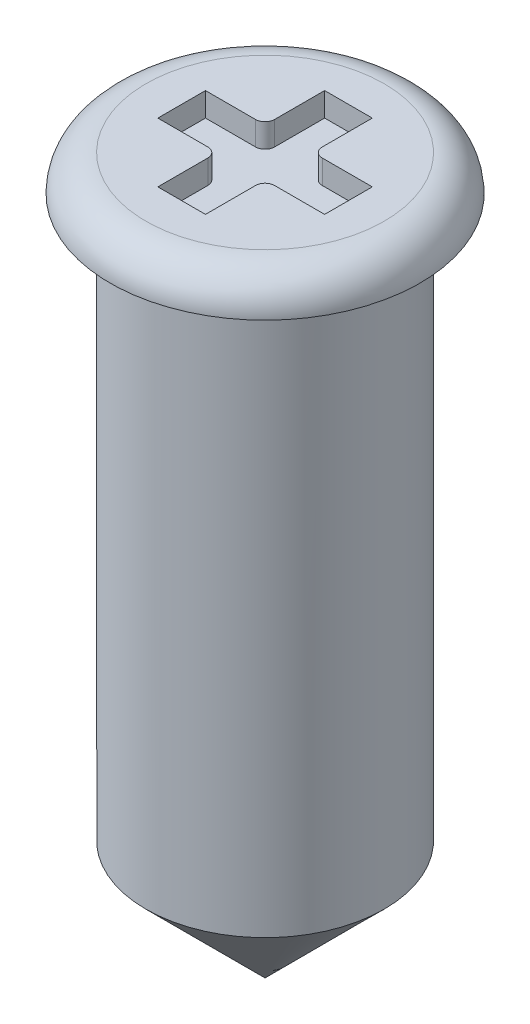
ISO-10303-21;
HEADER;
FILE_DESCRIPTION(('STEP AP214'),'2;1');
FILE_NAME('part.step','',(''),(''),'','','');
FILE_SCHEMA(('AUTOMOTIVE_DESIGN { 1 0 10303 214 1 1 1 1 }'));
ENDSEC;
DATA;
#1=APPLICATION_CONTEXT('core data for automotive mechanical design processes');
#2=APPLICATION_PROTOCOL_DEFINITION('international standard','automotive_design',2000,#1);
#3=PRODUCT_CONTEXT('',#1,'mechanical');
#4=PRODUCT('Part','Part','',(#3));
#5=PRODUCT_RELATED_PRODUCT_CATEGORY('part','',(#4));
#6=PRODUCT_DEFINITION_FORMATION('','',#4);
#7=PRODUCT_DEFINITION_CONTEXT('part definition',#1,'design');
#8=PRODUCT_DEFINITION('design','',#6,#7);
#9=PRODUCT_DEFINITION_SHAPE('','',#8);
#10=(LENGTH_UNIT() NAMED_UNIT(*) SI_UNIT(.MILLI.,.METRE.));
#11=(NAMED_UNIT(*) PLANE_ANGLE_UNIT() SI_UNIT($,.RADIAN.));
#12=(NAMED_UNIT(*) SI_UNIT($,.STERADIAN.) SOLID_ANGLE_UNIT());
#13=UNCERTAINTY_MEASURE_WITH_UNIT(LENGTH_MEASURE(1.E-05),#10,'distance_accuracy_value','');
#14=(GEOMETRIC_REPRESENTATION_CONTEXT(3) GLOBAL_UNCERTAINTY_ASSIGNED_CONTEXT((#13)) GLOBAL_UNIT_ASSIGNED_CONTEXT((#10,
#11,#12)) REPRESENTATION_CONTEXT('',''));
#15=CARTESIAN_POINT('',(0.,0.,0.));
#16=DIRECTION('',(0.,0.,1.));
#17=DIRECTION('',(1.,0.,0.));
#18=AXIS2_PLACEMENT_3D('',#15,#16,#17);
#19=CARTESIAN_POINT('',(0.,-22.5160076961522,0.));
#20=DIRECTION('',(0.,1.,0.));
#21=DIRECTION('',(0.,0.,1.));
#22=AXIS2_PLACEMENT_3D('',#19,#20,#21);
#23=CONICAL_SURFACE('',#22,0.,0.785398163397448);
#24=CARTESIAN_POINT('',(0.,-22.0160076961522,0.));
#25=DIRECTION('',(0.,-1.,0.));
#26=DIRECTION('',(0.,0.,-1.));
#27=AXIS2_PLACEMENT_3D('',#24,#25,#26);
#28=CIRCLE('',#27,0.5);
#29=CARTESIAN_POINT('',(0.,-22.0160076961522,-0.5));
#30=VERTEX_POINT('',#29);
#31=EDGE_CURVE('E11',#30,#30,#28,.T.);
#32=ORIENTED_EDGE('',*,*,#31,.T.);
#33=EDGE_LOOP('',(#32));
#34=FACE_BOUND('',#33,.T.);
#35=CARTESIAN_POINT('',(0.,-22.5160076961522,0.));
#36=VERTEX_POINT('',#35);
#37=VERTEX_LOOP('',#36);
#38=FACE_BOUND('',#37,.T.);
#39=ADVANCED_FACE('F45',(#34,#38),#23,.T.);
#40=CARTESIAN_POINT('',(0.,-22.5160076961522,0.));
#41=DIRECTION('',(0.,-1.,0.));
#42=DIRECTION('',(0.,0.,-1.));
#43=AXIS2_PLACEMENT_3D('',#40,#41,#42);
#44=CYLINDRICAL_SURFACE('',#43,0.5);
#45=CARTESIAN_POINT('',(0.,-19.6660076961522,0.));
#46=DIRECTION('',(0.,-1.,0.));
#47=DIRECTION('',(0.,0.,-1.));
#48=AXIS2_PLACEMENT_3D('',#45,#46,#47);
#49=CIRCLE('',#48,0.5);
#50=CARTESIAN_POINT('',(0.,-19.6660076961522,-0.5));
#51=VERTEX_POINT('',#50);
#52=EDGE_CURVE('E52',#51,#51,#49,.T.);
#53=ORIENTED_EDGE('',*,*,#52,.T.);
#54=EDGE_LOOP('',(#53));
#55=FACE_BOUND('',#54,.T.);
#56=ORIENTED_EDGE('',*,*,#31,.F.);
#57=EDGE_LOOP('',(#56));
#58=FACE_BOUND('',#57,.T.);
#59=ADVANCED_FACE('F299',(#55,#58),#44,.T.);
#60=CARTESIAN_POINT('',(0.65,-19.6660076961522,0.));
#61=DIRECTION('',(0.,-1.,0.));
#62=DIRECTION('',(0.,0.,-1.));
#63=AXIS2_PLACEMENT_3D('',#60,#61,#62);
#64=PLANE('',#63);
#65=CARTESIAN_POINT('',(0.,-19.6660076961522,0.));
#66=DIRECTION('',(0.,-1.,0.));
#67=DIRECTION('',(0.,0.,-1.));
#68=AXIS2_PLACEMENT_3D('',#65,#66,#67);
#69=CIRCLE('',#68,0.650000000000002);
#70=CARTESIAN_POINT('',(0.,-19.6660076961522,-0.650000000000002));
#71=VERTEX_POINT('',#70);
#72=EDGE_CURVE('E294',#71,#71,#69,.T.);
#73=ORIENTED_EDGE('',*,*,#72,.T.);
#74=EDGE_LOOP('',(#73));
#75=FACE_BOUND('',#74,.T.);
#76=ORIENTED_EDGE('',*,*,#52,.F.);
#77=EDGE_LOOP('',(#76));
#78=FACE_BOUND('',#77,.T.);
#79=ADVANCED_FACE('F302',(#75,#78),#64,.T.);
#80=CARTESIAN_POINT('',(0.,-19.6660076961522,0.));
#81=DIRECTION('',(0.,-1.,0.));
#82=DIRECTION('',(0.,0.,-1.));
#83=AXIS2_PLACEMENT_3D('',#80,#81,#82);
#84=TOROIDAL_SURFACE('',#83,0.5,0.150000000000002);
#85=CARTESIAN_POINT('',(0.,-19.5160076961522,0.));
#86=DIRECTION('',(0.,-1.,0.));
#87=DIRECTION('',(0.,0.,-1.));
#88=AXIS2_PLACEMENT_3D('',#85,#86,#87);
#89=CIRCLE('',#88,0.5);
#90=CARTESIAN_POINT('',(0.,-19.5160076961522,-0.5));
#91=VERTEX_POINT('',#90);
#92=EDGE_CURVE('E264',#91,#91,#89,.T.);
#93=ORIENTED_EDGE('',*,*,#92,.T.);
#94=EDGE_LOOP('',(#93));
#95=FACE_BOUND('',#94,.T.);
#96=ORIENTED_EDGE('',*,*,#72,.F.);
#97=EDGE_LOOP('',(#96));
#98=FACE_BOUND('',#97,.T.);
#99=ADVANCED_FACE('F304',(#95,#98),#84,.T.);
#100=CARTESIAN_POINT('',(0.,-19.5160076961522,0.));
#101=DIRECTION('',(0.,1.,0.));
#102=DIRECTION('',(0.,0.,1.));
#103=AXIS2_PLACEMENT_3D('',#100,#101,#102);
#104=PLANE('',#103);
#105=DIRECTION('',(0.,0.,-1.));
#106=VECTOR('',#105,1.);
#107=CARTESIAN_POINT('',(0.0999999999999998,-19.5160076961522,-0.35));
#108=LINE('',#107,#106);
#109=CARTESIAN_POINT('',(0.0999999999999999,-19.5160076961522,-0.14));
#110=VERTEX_POINT('',#109);
#111=CARTESIAN_POINT('',(0.0999999999999998,-19.5160076961522,-0.35));
#112=VERTEX_POINT('',#111);
#113=EDGE_CURVE('E59',#110,#112,#108,.T.);
#114=ORIENTED_EDGE('',*,*,#113,.F.);
#115=CARTESIAN_POINT('',(0.14,-19.5160076961522,-0.14));
#116=DIRECTION('',(0.,-1.,0.));
#117=DIRECTION('',(0.,0.,1.));
#118=AXIS2_PLACEMENT_3D('',#115,#116,#117);
#119=CIRCLE('',#118,0.04);
#120=CARTESIAN_POINT('',(0.14,-19.5160076961522,-0.1));
#121=VERTEX_POINT('',#120);
#122=EDGE_CURVE('E178',#121,#110,#119,.T.);
#123=ORIENTED_EDGE('',*,*,#122,.F.);
#124=DIRECTION('',(-1.,0.,0.));
#125=VECTOR('',#124,1.);
#126=CARTESIAN_POINT('',(0.14,-19.5160076961522,-0.1));
#127=LINE('',#126,#125);
#128=CARTESIAN_POINT('',(0.35,-19.5160076961522,-0.0999999999999999));
#129=VERTEX_POINT('',#128);
#130=EDGE_CURVE('E181',#129,#121,#127,.T.);
#131=ORIENTED_EDGE('',*,*,#130,.F.);
#132=DIRECTION('',(0.,0.,-1.));
#133=VECTOR('',#132,1.);
#134=CARTESIAN_POINT('',(0.35,-19.5160076961522,-0.0999999999999999));
#135=LINE('',#134,#133);
#136=CARTESIAN_POINT('',(0.35,-19.5160076961522,0.1));
#137=VERTEX_POINT('',#136);
#138=EDGE_CURVE('E257',#137,#129,#135,.T.);
#139=ORIENTED_EDGE('',*,*,#138,.F.);
#140=DIRECTION('',(1.,0.,0.));
#141=VECTOR('',#140,1.);
#142=CARTESIAN_POINT('',(0.35,-19.5160076961522,0.1));
#143=LINE('',#142,#141);
#144=CARTESIAN_POINT('',(0.14,-19.5160076961522,0.1));
#145=VERTEX_POINT('',#144);
#146=EDGE_CURVE('E254',#145,#137,#143,.T.);
#147=ORIENTED_EDGE('',*,*,#146,.F.);
#148=CARTESIAN_POINT('',(0.14,-19.5160076961522,0.14));
#149=DIRECTION('',(0.,-1.,0.));
#150=DIRECTION('',(0.,0.,1.));
#151=AXIS2_PLACEMENT_3D('',#148,#149,#150);
#152=CIRCLE('',#151,0.04);
#153=CARTESIAN_POINT('',(0.1,-19.5160076961522,0.14));
#154=VERTEX_POINT('',#153);
#155=EDGE_CURVE('E251',#154,#145,#152,.T.);
#156=ORIENTED_EDGE('',*,*,#155,.F.);
#157=DIRECTION('',(0.,0.,-1.));
#158=VECTOR('',#157,1.);
#159=CARTESIAN_POINT('',(0.1,-19.5160076961522,0.14));
#160=LINE('',#159,#158);
#161=CARTESIAN_POINT('',(0.1,-19.5160076961522,0.35));
#162=VERTEX_POINT('',#161);
#163=EDGE_CURVE('E248',#162,#154,#160,.T.);
#164=ORIENTED_EDGE('',*,*,#163,.F.);
#165=DIRECTION('',(1.,0.,0.));
#166=VECTOR('',#165,1.);
#167=CARTESIAN_POINT('',(0.1,-19.5160076961522,0.35));
#168=LINE('',#167,#166);
#169=CARTESIAN_POINT('',(-0.1,-19.5160076961522,0.35));
#170=VERTEX_POINT('',#169);
#171=EDGE_CURVE('E245',#170,#162,#168,.T.);
#172=ORIENTED_EDGE('',*,*,#171,.F.);
#173=DIRECTION('',(0.,0.,1.));
#174=VECTOR('',#173,1.);
#175=CARTESIAN_POINT('',(-0.1,-19.5160076961522,0.14));
#176=LINE('',#175,#174);
#177=CARTESIAN_POINT('',(-0.1,-19.5160076961522,0.14));
#178=VERTEX_POINT('',#177);
#179=EDGE_CURVE('E242',#178,#170,#176,.T.);
#180=ORIENTED_EDGE('',*,*,#179,.F.);
#181=CARTESIAN_POINT('',(-0.14,-19.5160076961522,0.14));
#182=DIRECTION('',(0.,-1.,0.));
#183=DIRECTION('',(0.,0.,-1.));
#184=AXIS2_PLACEMENT_3D('',#181,#182,#183);
#185=CIRCLE('',#184,0.04);
#186=CARTESIAN_POINT('',(-0.14,-19.5160076961522,0.1));
#187=VERTEX_POINT('',#186);
#188=EDGE_CURVE('E239',#187,#178,#185,.T.);
#189=ORIENTED_EDGE('',*,*,#188,.F.);
#190=DIRECTION('',(1.,0.,0.));
#191=VECTOR('',#190,1.);
#192=CARTESIAN_POINT('',(-0.35,-19.5160076961522,0.1));
#193=LINE('',#192,#191);
#194=CARTESIAN_POINT('',(-0.35,-19.5160076961522,0.1));
#195=VERTEX_POINT('',#194);
#196=EDGE_CURVE('E236',#195,#187,#193,.T.);
#197=ORIENTED_EDGE('',*,*,#196,.F.);
#198=DIRECTION('',(0.,0.,1.));
#199=VECTOR('',#198,1.);
#200=CARTESIAN_POINT('',(-0.35,-19.5160076961522,-0.0999999999999999));
#201=LINE('',#200,#199);
#202=CARTESIAN_POINT('',(-0.35,-19.5160076961522,-0.0999999999999999));
#203=VERTEX_POINT('',#202);
#204=EDGE_CURVE('E233',#203,#195,#201,.T.);
#205=ORIENTED_EDGE('',*,*,#204,.F.);
#206=DIRECTION('',(-1.,0.,0.));
#207=VECTOR('',#206,1.);
#208=CARTESIAN_POINT('',(-0.14,-19.5160076961522,-0.1));
#209=LINE('',#208,#207);
#210=CARTESIAN_POINT('',(-0.14,-19.5160076961522,-0.1));
#211=VERTEX_POINT('',#210);
#212=EDGE_CURVE('E230',#211,#203,#209,.T.);
#213=ORIENTED_EDGE('',*,*,#212,.F.);
#214=CARTESIAN_POINT('',(-0.14,-19.5160076961522,-0.14));
#215=DIRECTION('',(0.,-1.,0.));
#216=DIRECTION('',(0.,0.,-1.));
#217=AXIS2_PLACEMENT_3D('',#214,#215,#216);
#218=CIRCLE('',#217,0.04);
#219=CARTESIAN_POINT('',(-0.0999999999999999,-19.5160076961522,-0.14));
#220=VERTEX_POINT('',#219);
#221=EDGE_CURVE('E227',#220,#211,#218,.T.);
#222=ORIENTED_EDGE('',*,*,#221,.F.);
#223=DIRECTION('',(0.,0.,1.));
#224=VECTOR('',#223,1.);
#225=CARTESIAN_POINT('',(-0.0999999999999998,-19.5160076961522,-0.35));
#226=LINE('',#225,#224);
#227=CARTESIAN_POINT('',(-0.0999999999999998,-19.5160076961522,-0.35));
#228=VERTEX_POINT('',#227);
#229=EDGE_CURVE('E224',#228,#220,#226,.T.);
#230=ORIENTED_EDGE('',*,*,#229,.F.);
#231=DIRECTION('',(-1.,0.,0.));
#232=VECTOR('',#231,1.);
#233=CARTESIAN_POINT('',(-0.0999999999999998,-19.5160076961522,-0.35));
#234=LINE('',#233,#232);
#235=EDGE_CURVE('E222',#112,#228,#234,.T.);
#236=ORIENTED_EDGE('',*,*,#235,.F.);
#237=EDGE_LOOP('',(#114,#123,#131,#139,#147,#156,#164,#172,#180,#189,#197,#205,#213,#222,#230,#236));
#238=FACE_BOUND('',#237,.T.);
#239=ORIENTED_EDGE('',*,*,#92,.F.);
#240=EDGE_LOOP('',(#239));
#241=FACE_BOUND('',#240,.T.);
#242=ADVANCED_FACE('F311',(#238,#241),#104,.T.);
#243=CARTESIAN_POINT('',(0.0999999999999998,-19.6160076961522,-0.35));
#244=DIRECTION('',(1.,0.,0.));
#245=DIRECTION('',(0.,0.,-1.));
#246=AXIS2_PLACEMENT_3D('',#243,#244,#245);
#247=PLANE('',#246);
#248=ORIENTED_EDGE('',*,*,#113,.T.);
#249=DIRECTION('',(0.,1.,0.));
#250=VECTOR('',#249,1.);
#251=CARTESIAN_POINT('',(0.0999999999999998,-19.6160076961522,-0.35));
#252=LINE('',#251,#250);
#253=CARTESIAN_POINT('',(0.0999999999999998,-19.6160076961522,-0.35));
#254=VERTEX_POINT('',#253);
#255=EDGE_CURVE('E155',#254,#112,#252,.T.);
#256=ORIENTED_EDGE('',*,*,#255,.F.);
#257=DIRECTION('',(0.,0.,-1.));
#258=VECTOR('',#257,1.);
#259=CARTESIAN_POINT('',(0.0999999999999998,-19.6160076961522,-0.35));
#260=LINE('',#259,#258);
#261=CARTESIAN_POINT('',(0.0999999999999999,-19.6160076961522,-0.14));
#262=VERTEX_POINT('',#261);
#263=EDGE_CURVE('E159',#262,#254,#260,.T.);
#264=ORIENTED_EDGE('',*,*,#263,.F.);
#265=DIRECTION('',(0.,1.,0.));
#266=VECTOR('',#265,1.);
#267=CARTESIAN_POINT('',(0.0999999999999999,-19.6160076961522,-0.14));
#268=LINE('',#267,#266);
#269=EDGE_CURVE('E262',#262,#110,#268,.T.);
#270=ORIENTED_EDGE('',*,*,#269,.T.);
#271=EDGE_LOOP('',(#248,#256,#264,#270));
#272=FACE_BOUND('',#271,.T.);
#273=ADVANCED_FACE('F157',(#272),#247,.F.);
#274=CARTESIAN_POINT('',(0.14,-19.6160076961522,-0.14));
#275=DIRECTION('',(0.,1.,0.));
#276=DIRECTION('',(0.,0.,1.));
#277=AXIS2_PLACEMENT_3D('',#274,#275,#276);
#278=CYLINDRICAL_SURFACE('',#277,0.04);
#279=ORIENTED_EDGE('',*,*,#122,.T.);
#280=ORIENTED_EDGE('',*,*,#269,.F.);
#281=CARTESIAN_POINT('',(0.14,-19.6160076961522,-0.14));
#282=DIRECTION('',(0.,-1.,0.));
#283=DIRECTION('',(0.,0.,1.));
#284=AXIS2_PLACEMENT_3D('',#281,#282,#283);
#285=CIRCLE('',#284,0.04);
#286=CARTESIAN_POINT('',(0.14,-19.6160076961522,-0.1));
#287=VERTEX_POINT('',#286);
#288=EDGE_CURVE('E165',#287,#262,#285,.T.);
#289=ORIENTED_EDGE('',*,*,#288,.F.);
#290=DIRECTION('',(0.,1.,0.));
#291=VECTOR('',#290,1.);
#292=CARTESIAN_POINT('',(0.14,-19.6160076961522,-0.1));
#293=LINE('',#292,#291);
#294=EDGE_CURVE('E265',#287,#121,#293,.T.);
#295=ORIENTED_EDGE('',*,*,#294,.T.);
#296=EDGE_LOOP('',(#279,#280,#289,#295));
#297=FACE_BOUND('',#296,.T.);
#298=ADVANCED_FACE('F363',(#297),#278,.T.);
#299=CARTESIAN_POINT('',(0.14,-19.6160076961522,-0.1));
#300=DIRECTION('',(0.,0.,-1.));
#301=DIRECTION('',(-1.,0.,0.));
#302=AXIS2_PLACEMENT_3D('',#299,#300,#301);
#303=PLANE('',#302);
#304=ORIENTED_EDGE('',*,*,#130,.T.);
#305=ORIENTED_EDGE('',*,*,#294,.F.);
#306=DIRECTION('',(-1.,0.,0.));
#307=VECTOR('',#306,1.);
#308=CARTESIAN_POINT('',(0.14,-19.6160076961522,-0.1));
#309=LINE('',#308,#307);
#310=CARTESIAN_POINT('',(0.35,-19.6160076961522,-0.0999999999999999));
#311=VERTEX_POINT('',#310);
#312=EDGE_CURVE('E218',#311,#287,#309,.T.);
#313=ORIENTED_EDGE('',*,*,#312,.F.);
#314=DIRECTION('',(0.,1.,0.));
#315=VECTOR('',#314,1.);
#316=CARTESIAN_POINT('',(0.35,-19.6160076961522,-0.0999999999999999));
#317=LINE('',#316,#315);
#318=EDGE_CURVE('E267',#311,#129,#317,.T.);
#319=ORIENTED_EDGE('',*,*,#318,.T.);
#320=EDGE_LOOP('',(#304,#305,#313,#319));
#321=FACE_BOUND('',#320,.T.);
#322=ADVANCED_FACE('F373',(#321),#303,.F.);
#323=CARTESIAN_POINT('',(0.35,-19.6160076961522,-0.0999999999999999));
#324=DIRECTION('',(1.,0.,0.));
#325=DIRECTION('',(0.,0.,-1.));
#326=AXIS2_PLACEMENT_3D('',#323,#324,#325);
#327=PLANE('',#326);
#328=ORIENTED_EDGE('',*,*,#138,.T.);
#329=ORIENTED_EDGE('',*,*,#318,.F.);
#330=DIRECTION('',(0.,0.,-1.));
#331=VECTOR('',#330,1.);
#332=CARTESIAN_POINT('',(0.35,-19.6160076961522,-0.0999999999999999));
#333=LINE('',#332,#331);
#334=CARTESIAN_POINT('',(0.35,-19.6160076961522,0.1));
#335=VERTEX_POINT('',#334);
#336=EDGE_CURVE('E215',#335,#311,#333,.T.);
#337=ORIENTED_EDGE('',*,*,#336,.F.);
#338=DIRECTION('',(0.,1.,0.));
#339=VECTOR('',#338,1.);
#340=CARTESIAN_POINT('',(0.35,-19.6160076961522,0.1));
#341=LINE('',#340,#339);
#342=EDGE_CURVE('E269',#335,#137,#341,.T.);
#343=ORIENTED_EDGE('',*,*,#342,.T.);
#344=EDGE_LOOP('',(#328,#329,#337,#343));
#345=FACE_BOUND('',#344,.T.);
#346=ADVANCED_FACE('F384',(#345),#327,.F.);
#347=CARTESIAN_POINT('',(0.35,-19.6160076961522,0.1));
#348=DIRECTION('',(0.,0.,1.));
#349=DIRECTION('',(1.,0.,0.));
#350=AXIS2_PLACEMENT_3D('',#347,#348,#349);
#351=PLANE('',#350);
#352=ORIENTED_EDGE('',*,*,#146,.T.);
#353=ORIENTED_EDGE('',*,*,#342,.F.);
#354=DIRECTION('',(1.,0.,0.));
#355=VECTOR('',#354,1.);
#356=CARTESIAN_POINT('',(0.35,-19.6160076961522,0.1));
#357=LINE('',#356,#355);
#358=CARTESIAN_POINT('',(0.14,-19.6160076961522,0.1));
#359=VERTEX_POINT('',#358);
#360=EDGE_CURVE('E212',#359,#335,#357,.T.);
#361=ORIENTED_EDGE('',*,*,#360,.F.);
#362=DIRECTION('',(0.,1.,0.));
#363=VECTOR('',#362,1.);
#364=CARTESIAN_POINT('',(0.14,-19.6160076961522,0.1));
#365=LINE('',#364,#363);
#366=EDGE_CURVE('E271',#359,#145,#365,.T.);
#367=ORIENTED_EDGE('',*,*,#366,.T.);
#368=EDGE_LOOP('',(#352,#353,#361,#367));
#369=FACE_BOUND('',#368,.T.);
#370=ADVANCED_FACE('F395',(#369),#351,.F.);
#371=CARTESIAN_POINT('',(0.14,-19.6160076961522,0.14));
#372=DIRECTION('',(0.,1.,0.));
#373=DIRECTION('',(0.,0.,1.));
#374=AXIS2_PLACEMENT_3D('',#371,#372,#373);
#375=CYLINDRICAL_SURFACE('',#374,0.04);
#376=ORIENTED_EDGE('',*,*,#155,.T.);
#377=ORIENTED_EDGE('',*,*,#366,.F.);
#378=CARTESIAN_POINT('',(0.14,-19.6160076961522,0.14));
#379=DIRECTION('',(0.,-1.,0.));
#380=DIRECTION('',(0.,0.,1.));
#381=AXIS2_PLACEMENT_3D('',#378,#379,#380);
#382=CIRCLE('',#381,0.04);
#383=CARTESIAN_POINT('',(0.1,-19.6160076961522,0.14));
#384=VERTEX_POINT('',#383);
#385=EDGE_CURVE('E209',#384,#359,#382,.T.);
#386=ORIENTED_EDGE('',*,*,#385,.F.);
#387=DIRECTION('',(0.,1.,0.));
#388=VECTOR('',#387,1.);
#389=CARTESIAN_POINT('',(0.1,-19.6160076961522,0.14));
#390=LINE('',#389,#388);
#391=EDGE_CURVE('E273',#384,#154,#390,.T.);
#392=ORIENTED_EDGE('',*,*,#391,.T.);
#393=EDGE_LOOP('',(#376,#377,#386,#392));
#394=FACE_BOUND('',#393,.T.);
#395=ADVANCED_FACE('F406',(#394),#375,.T.);
#396=CARTESIAN_POINT('',(0.1,-19.6160076961522,0.14));
#397=DIRECTION('',(1.,0.,0.));
#398=DIRECTION('',(0.,0.,-1.));
#399=AXIS2_PLACEMENT_3D('',#396,#397,#398);
#400=PLANE('',#399);
#401=ORIENTED_EDGE('',*,*,#163,.T.);
#402=ORIENTED_EDGE('',*,*,#391,.F.);
#403=DIRECTION('',(0.,0.,-1.));
#404=VECTOR('',#403,1.);
#405=CARTESIAN_POINT('',(0.1,-19.6160076961522,0.14));
#406=LINE('',#405,#404);
#407=CARTESIAN_POINT('',(0.1,-19.6160076961522,0.35));
#408=VERTEX_POINT('',#407);
#409=EDGE_CURVE('E206',#408,#384,#406,.T.);
#410=ORIENTED_EDGE('',*,*,#409,.F.);
#411=DIRECTION('',(0.,1.,0.));
#412=VECTOR('',#411,1.);
#413=CARTESIAN_POINT('',(0.1,-19.6160076961522,0.35));
#414=LINE('',#413,#412);
#415=EDGE_CURVE('E275',#408,#162,#414,.T.);
#416=ORIENTED_EDGE('',*,*,#415,.T.);
#417=EDGE_LOOP('',(#401,#402,#410,#416));
#418=FACE_BOUND('',#417,.T.);
#419=ADVANCED_FACE('F417',(#418),#400,.F.);
#420=CARTESIAN_POINT('',(0.1,-19.6160076961522,0.35));
#421=DIRECTION('',(0.,0.,1.));
#422=DIRECTION('',(1.,0.,0.));
#423=AXIS2_PLACEMENT_3D('',#420,#421,#422);
#424=PLANE('',#423);
#425=ORIENTED_EDGE('',*,*,#171,.T.);
#426=ORIENTED_EDGE('',*,*,#415,.F.);
#427=DIRECTION('',(1.,0.,0.));
#428=VECTOR('',#427,1.);
#429=CARTESIAN_POINT('',(0.1,-19.6160076961522,0.35));
#430=LINE('',#429,#428);
#431=CARTESIAN_POINT('',(-0.1,-19.6160076961522,0.35));
#432=VERTEX_POINT('',#431);
#433=EDGE_CURVE('E203',#432,#408,#430,.T.);
#434=ORIENTED_EDGE('',*,*,#433,.F.);
#435=DIRECTION('',(0.,1.,0.));
#436=VECTOR('',#435,1.);
#437=CARTESIAN_POINT('',(-0.1,-19.6160076961522,0.35));
#438=LINE('',#437,#436);
#439=EDGE_CURVE('E277',#432,#170,#438,.T.);
#440=ORIENTED_EDGE('',*,*,#439,.T.);
#441=EDGE_LOOP('',(#425,#426,#434,#440));
#442=FACE_BOUND('',#441,.T.);
#443=ADVANCED_FACE('F428',(#442),#424,.F.);
#444=CARTESIAN_POINT('',(-0.1,-19.6160076961522,0.14));
#445=DIRECTION('',(-1.,0.,0.));
#446=DIRECTION('',(0.,0.,1.));
#447=AXIS2_PLACEMENT_3D('',#444,#445,#446);
#448=PLANE('',#447);
#449=ORIENTED_EDGE('',*,*,#179,.T.);
#450=ORIENTED_EDGE('',*,*,#439,.F.);
#451=DIRECTION('',(0.,0.,1.));
#452=VECTOR('',#451,1.);
#453=CARTESIAN_POINT('',(-0.1,-19.6160076961522,0.14));
#454=LINE('',#453,#452);
#455=CARTESIAN_POINT('',(-0.1,-19.6160076961522,0.14));
#456=VERTEX_POINT('',#455);
#457=EDGE_CURVE('E200',#456,#432,#454,.T.);
#458=ORIENTED_EDGE('',*,*,#457,.F.);
#459=DIRECTION('',(0.,1.,0.));
#460=VECTOR('',#459,1.);
#461=CARTESIAN_POINT('',(-0.1,-19.6160076961522,0.14));
#462=LINE('',#461,#460);
#463=EDGE_CURVE('E279',#456,#178,#462,.T.);
#464=ORIENTED_EDGE('',*,*,#463,.T.);
#465=EDGE_LOOP('',(#449,#450,#458,#464));
#466=FACE_BOUND('',#465,.T.);
#467=ADVANCED_FACE('F439',(#466),#448,.F.);
#468=CARTESIAN_POINT('',(-0.14,-19.6160076961522,0.14));
#469=DIRECTION('',(0.,1.,0.));
#470=DIRECTION('',(0.,0.,1.));
#471=AXIS2_PLACEMENT_3D('',#468,#469,#470);
#472=CYLINDRICAL_SURFACE('',#471,0.04);
#473=ORIENTED_EDGE('',*,*,#188,.T.);
#474=ORIENTED_EDGE('',*,*,#463,.F.);
#475=CARTESIAN_POINT('',(-0.14,-19.6160076961522,0.14));
#476=DIRECTION('',(0.,-1.,0.));
#477=DIRECTION('',(0.,0.,-1.));
#478=AXIS2_PLACEMENT_3D('',#475,#476,#477);
#479=CIRCLE('',#478,0.04);
#480=CARTESIAN_POINT('',(-0.14,-19.6160076961522,0.1));
#481=VERTEX_POINT('',#480);
#482=EDGE_CURVE('E197',#481,#456,#479,.T.);
#483=ORIENTED_EDGE('',*,*,#482,.F.);
#484=DIRECTION('',(0.,1.,0.));
#485=VECTOR('',#484,1.);
#486=CARTESIAN_POINT('',(-0.14,-19.6160076961522,0.1));
#487=LINE('',#486,#485);
#488=EDGE_CURVE('E281',#481,#187,#487,.T.);
#489=ORIENTED_EDGE('',*,*,#488,.T.);
#490=EDGE_LOOP('',(#473,#474,#483,#489));
#491=FACE_BOUND('',#490,.T.);
#492=ADVANCED_FACE('F450',(#491),#472,.T.);
#493=CARTESIAN_POINT('',(-0.35,-19.6160076961522,0.1));
#494=DIRECTION('',(0.,0.,1.));
#495=DIRECTION('',(1.,0.,0.));
#496=AXIS2_PLACEMENT_3D('',#493,#494,#495);
#497=PLANE('',#496);
#498=ORIENTED_EDGE('',*,*,#196,.T.);
#499=ORIENTED_EDGE('',*,*,#488,.F.);
#500=DIRECTION('',(1.,0.,0.));
#501=VECTOR('',#500,1.);
#502=CARTESIAN_POINT('',(-0.35,-19.6160076961522,0.1));
#503=LINE('',#502,#501);
#504=CARTESIAN_POINT('',(-0.35,-19.6160076961522,0.1));
#505=VERTEX_POINT('',#504);
#506=EDGE_CURVE('E194',#505,#481,#503,.T.);
#507=ORIENTED_EDGE('',*,*,#506,.F.);
#508=DIRECTION('',(0.,1.,0.));
#509=VECTOR('',#508,1.);
#510=CARTESIAN_POINT('',(-0.35,-19.6160076961522,0.1));
#511=LINE('',#510,#509);
#512=EDGE_CURVE('E283',#505,#195,#511,.T.);
#513=ORIENTED_EDGE('',*,*,#512,.T.);
#514=EDGE_LOOP('',(#498,#499,#507,#513));
#515=FACE_BOUND('',#514,.T.);
#516=ADVANCED_FACE('F461',(#515),#497,.F.);
#517=CARTESIAN_POINT('',(-0.35,-19.6160076961522,-0.0999999999999999));
#518=DIRECTION('',(-1.,0.,0.));
#519=DIRECTION('',(0.,0.,1.));
#520=AXIS2_PLACEMENT_3D('',#517,#518,#519);
#521=PLANE('',#520);
#522=ORIENTED_EDGE('',*,*,#204,.T.);
#523=ORIENTED_EDGE('',*,*,#512,.F.);
#524=DIRECTION('',(0.,0.,1.));
#525=VECTOR('',#524,1.);
#526=CARTESIAN_POINT('',(-0.35,-19.6160076961522,-0.0999999999999999));
#527=LINE('',#526,#525);
#528=CARTESIAN_POINT('',(-0.35,-19.6160076961522,-0.0999999999999999));
#529=VERTEX_POINT('',#528);
#530=EDGE_CURVE('E191',#529,#505,#527,.T.);
#531=ORIENTED_EDGE('',*,*,#530,.F.);
#532=DIRECTION('',(0.,1.,0.));
#533=VECTOR('',#532,1.);
#534=CARTESIAN_POINT('',(-0.35,-19.6160076961522,-0.0999999999999999));
#535=LINE('',#534,#533);
#536=EDGE_CURVE('E285',#529,#203,#535,.T.);
#537=ORIENTED_EDGE('',*,*,#536,.T.);
#538=EDGE_LOOP('',(#522,#523,#531,#537));
#539=FACE_BOUND('',#538,.T.);
#540=ADVANCED_FACE('F472',(#539),#521,.F.);
#541=CARTESIAN_POINT('',(-0.14,-19.6160076961522,-0.1));
#542=DIRECTION('',(0.,0.,-1.));
#543=DIRECTION('',(-1.,0.,0.));
#544=AXIS2_PLACEMENT_3D('',#541,#542,#543);
#545=PLANE('',#544);
#546=ORIENTED_EDGE('',*,*,#212,.T.);
#547=ORIENTED_EDGE('',*,*,#536,.F.);
#548=DIRECTION('',(-1.,0.,0.));
#549=VECTOR('',#548,1.);
#550=CARTESIAN_POINT('',(-0.14,-19.6160076961522,-0.1));
#551=LINE('',#550,#549);
#552=CARTESIAN_POINT('',(-0.14,-19.6160076961522,-0.1));
#553=VERTEX_POINT('',#552);
#554=EDGE_CURVE('E188',#553,#529,#551,.T.);
#555=ORIENTED_EDGE('',*,*,#554,.F.);
#556=DIRECTION('',(0.,1.,0.));
#557=VECTOR('',#556,1.);
#558=CARTESIAN_POINT('',(-0.14,-19.6160076961522,-0.1));
#559=LINE('',#558,#557);
#560=EDGE_CURVE('E287',#553,#211,#559,.T.);
#561=ORIENTED_EDGE('',*,*,#560,.T.);
#562=EDGE_LOOP('',(#546,#547,#555,#561));
#563=FACE_BOUND('',#562,.T.);
#564=ADVANCED_FACE('F483',(#563),#545,.F.);
#565=CARTESIAN_POINT('',(-0.14,-19.6160076961522,-0.14));
#566=DIRECTION('',(0.,1.,0.));
#567=DIRECTION('',(0.,0.,1.));
#568=AXIS2_PLACEMENT_3D('',#565,#566,#567);
#569=CYLINDRICAL_SURFACE('',#568,0.04);
#570=ORIENTED_EDGE('',*,*,#221,.T.);
#571=ORIENTED_EDGE('',*,*,#560,.F.);
#572=CARTESIAN_POINT('',(-0.14,-19.6160076961522,-0.14));
#573=DIRECTION('',(0.,-1.,0.));
#574=DIRECTION('',(0.,0.,-1.));
#575=AXIS2_PLACEMENT_3D('',#572,#573,#574);
#576=CIRCLE('',#575,0.04);
#577=CARTESIAN_POINT('',(-0.0999999999999999,-19.6160076961522,-0.14));
#578=VERTEX_POINT('',#577);
#579=EDGE_CURVE('E185',#578,#553,#576,.T.);
#580=ORIENTED_EDGE('',*,*,#579,.F.);
#581=DIRECTION('',(0.,1.,0.));
#582=VECTOR('',#581,1.);
#583=CARTESIAN_POINT('',(-0.0999999999999999,-19.6160076961522,-0.14));
#584=LINE('',#583,#582);
#585=EDGE_CURVE('E289',#578,#220,#584,.T.);
#586=ORIENTED_EDGE('',*,*,#585,.T.);
#587=EDGE_LOOP('',(#570,#571,#580,#586));
#588=FACE_BOUND('',#587,.T.);
#589=ADVANCED_FACE('F494',(#588),#569,.T.);
#590=CARTESIAN_POINT('',(-0.0999999999999998,-19.6160076961522,-0.35));
#591=DIRECTION('',(-1.,0.,0.));
#592=DIRECTION('',(0.,0.,1.));
#593=AXIS2_PLACEMENT_3D('',#590,#591,#592);
#594=PLANE('',#593);
#595=ORIENTED_EDGE('',*,*,#229,.T.);
#596=ORIENTED_EDGE('',*,*,#585,.F.);
#597=DIRECTION('',(0.,0.,1.));
#598=VECTOR('',#597,1.);
#599=CARTESIAN_POINT('',(-0.0999999999999998,-19.6160076961522,-0.35));
#600=LINE('',#599,#598);
#601=CARTESIAN_POINT('',(-0.0999999999999998,-19.6160076961522,-0.35));
#602=VERTEX_POINT('',#601);
#603=EDGE_CURVE('E173',#602,#578,#600,.T.);
#604=ORIENTED_EDGE('',*,*,#603,.F.);
#605=DIRECTION('',(0.,1.,0.));
#606=VECTOR('',#605,1.);
#607=CARTESIAN_POINT('',(-0.0999999999999998,-19.6160076961522,-0.35));
#608=LINE('',#607,#606);
#609=EDGE_CURVE('E164',#602,#228,#608,.T.);
#610=ORIENTED_EDGE('',*,*,#609,.T.);
#611=EDGE_LOOP('',(#595,#596,#604,#610));
#612=FACE_BOUND('',#611,.T.);
#613=ADVANCED_FACE('F505',(#612),#594,.F.);
#614=CARTESIAN_POINT('',(-0.0999999999999998,-19.6160076961522,-0.35));
#615=DIRECTION('',(0.,0.,-1.));
#616=DIRECTION('',(-1.,0.,0.));
#617=AXIS2_PLACEMENT_3D('',#614,#615,#616);
#618=PLANE('',#617);
#619=ORIENTED_EDGE('',*,*,#235,.T.);
#620=ORIENTED_EDGE('',*,*,#609,.F.);
#621=DIRECTION('',(-1.,0.,0.));
#622=VECTOR('',#621,1.);
#623=CARTESIAN_POINT('',(-0.0999999999999998,-19.6160076961522,-0.35));
#624=LINE('',#623,#622);
#625=EDGE_CURVE('E168',#254,#602,#624,.T.);
#626=ORIENTED_EDGE('',*,*,#625,.F.);
#627=ORIENTED_EDGE('',*,*,#255,.T.);
#628=EDGE_LOOP('',(#619,#620,#626,#627));
#629=FACE_BOUND('',#628,.T.);
#630=ADVANCED_FACE('F169',(#629),#618,.F.);
#631=CARTESIAN_POINT('',(0.14,-19.6160076961522,-0.14));
#632=DIRECTION('',(0.,1.,0.));
#633=DIRECTION('',(0.,0.,1.));
#634=AXIS2_PLACEMENT_3D('',#631,#632,#633);
#635=PLANE('',#634);
#636=ORIENTED_EDGE('',*,*,#263,.T.);
#637=ORIENTED_EDGE('',*,*,#625,.T.);
#638=ORIENTED_EDGE('',*,*,#603,.T.);
#639=ORIENTED_EDGE('',*,*,#579,.T.);
#640=ORIENTED_EDGE('',*,*,#554,.T.);
#641=ORIENTED_EDGE('',*,*,#530,.T.);
#642=ORIENTED_EDGE('',*,*,#506,.T.);
#643=ORIENTED_EDGE('',*,*,#482,.T.);
#644=ORIENTED_EDGE('',*,*,#457,.T.);
#645=ORIENTED_EDGE('',*,*,#433,.T.);
#646=ORIENTED_EDGE('',*,*,#409,.T.);
#647=ORIENTED_EDGE('',*,*,#385,.T.);
#648=ORIENTED_EDGE('',*,*,#360,.T.);
#649=ORIENTED_EDGE('',*,*,#336,.T.);
#650=ORIENTED_EDGE('',*,*,#312,.T.);
#651=ORIENTED_EDGE('',*,*,#288,.T.);
#652=EDGE_LOOP('',(#636,#637,#638,#639,#640,#641,#642,#643,#644,#645,#646,#647,#648,#649,#650,#651));
#653=FACE_BOUND('',#652,.T.);
#654=ADVANCED_FACE('F175',(#653),#635,.T.);
#655=CLOSED_SHELL('',(#39,#59,#79,#99,#242,#273,#298,#322,#346,#370,#395,#419,#443,#467,#492,
#516,#540,#564,#589,#613,#630,#654));
#656=MANIFOLD_SOLID_BREP('B2',#655);
#657=ADVANCED_BREP_SHAPE_REPRESENTATION('',(#18,#656),#14);
#658=SHAPE_DEFINITION_REPRESENTATION(#9,#657);
ENDSEC;
END-ISO-10303-21;
